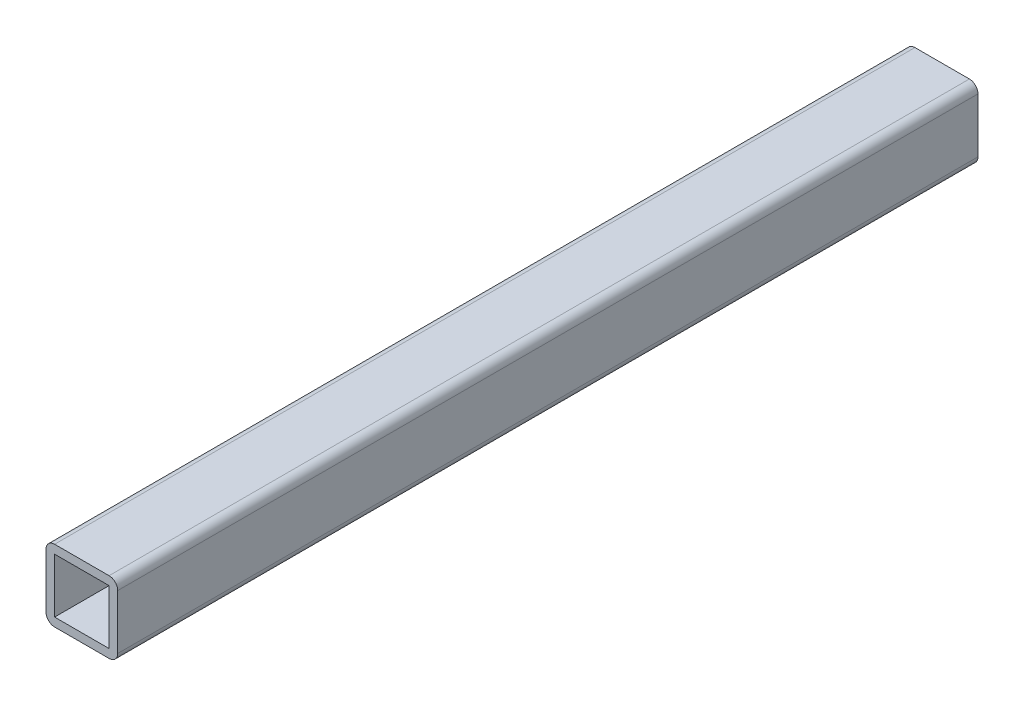
ISO-10303-21;
HEADER;
FILE_DESCRIPTION(('STEP AP214'),'2;1');
FILE_NAME('part.step','',(''),(''),'','','');
FILE_SCHEMA(('AUTOMOTIVE_DESIGN { 1 0 10303 214 1 1 1 1 }'));
ENDSEC;
DATA;
#1=APPLICATION_CONTEXT('core data for automotive mechanical design processes');
#2=APPLICATION_PROTOCOL_DEFINITION('international standard','automotive_design',2000,#1);
#3=PRODUCT_CONTEXT('',#1,'mechanical');
#4=PRODUCT('Part','Part','',(#3));
#5=PRODUCT_RELATED_PRODUCT_CATEGORY('part','',(#4));
#6=PRODUCT_DEFINITION_FORMATION('','',#4);
#7=PRODUCT_DEFINITION_CONTEXT('part definition',#1,'design');
#8=PRODUCT_DEFINITION('design','',#6,#7);
#9=PRODUCT_DEFINITION_SHAPE('','',#8);
#10=(LENGTH_UNIT() NAMED_UNIT(*) SI_UNIT(.MILLI.,.METRE.));
#11=(NAMED_UNIT(*) PLANE_ANGLE_UNIT() SI_UNIT($,.RADIAN.));
#12=(NAMED_UNIT(*) SI_UNIT($,.STERADIAN.) SOLID_ANGLE_UNIT());
#13=UNCERTAINTY_MEASURE_WITH_UNIT(LENGTH_MEASURE(1.E-05),#10,'distance_accuracy_value','');
#14=(GEOMETRIC_REPRESENTATION_CONTEXT(3) GLOBAL_UNCERTAINTY_ASSIGNED_CONTEXT((#13)) GLOBAL_UNIT_ASSIGNED_CONTEXT((#10,
#11,#12)) REPRESENTATION_CONTEXT('',''));
#15=CARTESIAN_POINT('',(0.,0.,0.));
#16=DIRECTION('',(0.,0.,1.));
#17=DIRECTION('',(1.,0.,0.));
#18=AXIS2_PLACEMENT_3D('',#15,#16,#17);
#19=CARTESIAN_POINT('',(-9.5,-9.5,300.));
#20=DIRECTION('',(0.,0.,1.));
#21=DIRECTION('',(1.,0.,0.));
#22=AXIS2_PLACEMENT_3D('',#19,#20,#21);
#23=PLANE('',#22);
#24=CARTESIAN_POINT('',(-9.5,-9.5,300.));
#25=DIRECTION('',(0.,0.,1.));
#26=DIRECTION('',(1.,0.,0.));
#27=AXIS2_PLACEMENT_3D('',#24,#25,#26);
#28=CIRCLE('',#27,3.);
#29=CARTESIAN_POINT('',(-12.5,-9.5,300.));
#30=VERTEX_POINT('',#29);
#31=CARTESIAN_POINT('',(-9.5,-12.5,300.));
#32=VERTEX_POINT('',#31);
#33=EDGE_CURVE('E157',#30,#32,#28,.T.);
#34=ORIENTED_EDGE('',*,*,#33,.T.);
#35=DIRECTION('',(1.,0.,0.));
#36=VECTOR('',#35,1.);
#37=CARTESIAN_POINT('',(-9.5,-12.5,300.));
#38=LINE('',#37,#36);
#39=CARTESIAN_POINT('',(9.5,-12.5,300.));
#40=VERTEX_POINT('',#39);
#41=EDGE_CURVE('E160',#32,#40,#38,.T.);
#42=ORIENTED_EDGE('',*,*,#41,.T.);
#43=CARTESIAN_POINT('',(9.5,-9.5,300.));
#44=DIRECTION('',(0.,0.,1.));
#45=DIRECTION('',(1.,0.,0.));
#46=AXIS2_PLACEMENT_3D('',#43,#44,#45);
#47=CIRCLE('',#46,3.);
#48=CARTESIAN_POINT('',(12.5,-9.5,300.));
#49=VERTEX_POINT('',#48);
#50=EDGE_CURVE('E163',#40,#49,#47,.T.);
#51=ORIENTED_EDGE('',*,*,#50,.T.);
#52=DIRECTION('',(0.,1.,0.));
#53=VECTOR('',#52,1.);
#54=CARTESIAN_POINT('',(12.5,-9.5,300.));
#55=LINE('',#54,#53);
#56=CARTESIAN_POINT('',(12.5,9.5,300.));
#57=VERTEX_POINT('',#56);
#58=EDGE_CURVE('E165',#49,#57,#55,.T.);
#59=ORIENTED_EDGE('',*,*,#58,.T.);
#60=CARTESIAN_POINT('',(9.5,9.5,300.));
#61=DIRECTION('',(0.,0.,1.));
#62=DIRECTION('',(1.,0.,0.));
#63=AXIS2_PLACEMENT_3D('',#60,#61,#62);
#64=CIRCLE('',#63,3.);
#65=CARTESIAN_POINT('',(9.5,12.5,300.));
#66=VERTEX_POINT('',#65);
#67=EDGE_CURVE('E167',#57,#66,#64,.T.);
#68=ORIENTED_EDGE('',*,*,#67,.T.);
#69=DIRECTION('',(-1.,0.,0.));
#70=VECTOR('',#69,1.);
#71=CARTESIAN_POINT('',(-9.5,12.5,300.));
#72=LINE('',#71,#70);
#73=CARTESIAN_POINT('',(-9.5,12.5,300.));
#74=VERTEX_POINT('',#73);
#75=EDGE_CURVE('E169',#66,#74,#72,.T.);
#76=ORIENTED_EDGE('',*,*,#75,.T.);
#77=CARTESIAN_POINT('',(-9.5,9.5,300.));
#78=DIRECTION('',(0.,0.,1.));
#79=DIRECTION('',(-1.,0.,0.));
#80=AXIS2_PLACEMENT_3D('',#77,#78,#79);
#81=CIRCLE('',#80,3.);
#82=CARTESIAN_POINT('',(-12.5,9.5,300.));
#83=VERTEX_POINT('',#82);
#84=EDGE_CURVE('E171',#74,#83,#81,.T.);
#85=ORIENTED_EDGE('',*,*,#84,.T.);
#86=DIRECTION('',(0.,-1.,0.));
#87=VECTOR('',#86,1.);
#88=CARTESIAN_POINT('',(-12.5,-9.5,300.));
#89=LINE('',#88,#87);
#90=EDGE_CURVE('E173',#83,#30,#89,.T.);
#91=ORIENTED_EDGE('',*,*,#90,.T.);
#92=EDGE_LOOP('',(#34,#42,#51,#59,#68,#76,#85,#91));
#93=FACE_BOUND('',#92,.T.);
#94=DIRECTION('',(1.,0.,0.));
#95=VECTOR('',#94,1.);
#96=CARTESIAN_POINT('',(-9.5,-9.5,300.));
#97=LINE('',#96,#95);
#98=CARTESIAN_POINT('',(-9.5,-9.5,300.));
#99=VERTEX_POINT('',#98);
#100=CARTESIAN_POINT('',(9.5,-9.5,300.));
#101=VERTEX_POINT('',#100);
#102=EDGE_CURVE('E129',#99,#101,#97,.T.);
#103=ORIENTED_EDGE('',*,*,#102,.F.);
#104=DIRECTION('',(0.,-1.,0.));
#105=VECTOR('',#104,1.);
#106=CARTESIAN_POINT('',(-9.5,-9.5,300.));
#107=LINE('',#106,#105);
#108=CARTESIAN_POINT('',(-9.5,9.5,300.));
#109=VERTEX_POINT('',#108);
#110=EDGE_CURVE('E121',#109,#99,#107,.T.);
#111=ORIENTED_EDGE('',*,*,#110,.F.);
#112=DIRECTION('',(-1.,0.,0.));
#113=VECTOR('',#112,1.);
#114=CARTESIAN_POINT('',(-9.5,9.5,300.));
#115=LINE('',#114,#113);
#116=CARTESIAN_POINT('',(9.49999999999999,9.5,300.));
#117=VERTEX_POINT('',#116);
#118=EDGE_CURVE('E143',#117,#109,#115,.T.);
#119=ORIENTED_EDGE('',*,*,#118,.F.);
#120=DIRECTION('',(0.,1.,0.));
#121=VECTOR('',#120,1.);
#122=CARTESIAN_POINT('',(9.5,-9.5,300.));
#123=LINE('',#122,#121);
#124=EDGE_CURVE('E141',#101,#117,#123,.T.);
#125=ORIENTED_EDGE('',*,*,#124,.F.);
#126=EDGE_LOOP('',(#103,#111,#119,#125));
#127=FACE_BOUND('',#126,.T.);
#128=ADVANCED_FACE('F32',(#93,#127),#23,.T.);
#129=CARTESIAN_POINT('',(-9.5,-9.5,0.));
#130=DIRECTION('',(0.,0.,1.));
#131=DIRECTION('',(1.,0.,0.));
#132=AXIS2_PLACEMENT_3D('',#129,#130,#131);
#133=PLANE('',#132);
#134=CARTESIAN_POINT('',(-9.5,-9.5,0.));
#135=DIRECTION('',(0.,0.,1.));
#136=DIRECTION('',(1.,0.,0.));
#137=AXIS2_PLACEMENT_3D('',#134,#135,#136);
#138=CIRCLE('',#137,3.);
#139=CARTESIAN_POINT('',(-12.5,-9.5,0.));
#140=VERTEX_POINT('',#139);
#141=CARTESIAN_POINT('',(-9.5,-12.5,0.));
#142=VERTEX_POINT('',#141);
#143=EDGE_CURVE('E137',#140,#142,#138,.T.);
#144=ORIENTED_EDGE('',*,*,#143,.F.);
#145=DIRECTION('',(0.,-1.,0.));
#146=VECTOR('',#145,1.);
#147=CARTESIAN_POINT('',(-12.5,-9.5,0.));
#148=LINE('',#147,#146);
#149=CARTESIAN_POINT('',(-12.5,9.5,0.));
#150=VERTEX_POINT('',#149);
#151=EDGE_CURVE('E161',#150,#140,#148,.T.);
#152=ORIENTED_EDGE('',*,*,#151,.F.);
#153=CARTESIAN_POINT('',(-9.5,9.5,0.));
#154=DIRECTION('',(0.,0.,1.));
#155=DIRECTION('',(-1.,0.,0.));
#156=AXIS2_PLACEMENT_3D('',#153,#154,#155);
#157=CIRCLE('',#156,3.);
#158=CARTESIAN_POINT('',(-9.5,12.5,0.));
#159=VERTEX_POINT('',#158);
#160=EDGE_CURVE('E188',#159,#150,#157,.T.);
#161=ORIENTED_EDGE('',*,*,#160,.F.);
#162=DIRECTION('',(-1.,0.,0.));
#163=VECTOR('',#162,1.);
#164=CARTESIAN_POINT('',(-9.5,12.5,0.));
#165=LINE('',#164,#163);
#166=CARTESIAN_POINT('',(9.5,12.5,0.));
#167=VERTEX_POINT('',#166);
#168=EDGE_CURVE('E186',#167,#159,#165,.T.);
#169=ORIENTED_EDGE('',*,*,#168,.F.);
#170=CARTESIAN_POINT('',(9.5,9.5,0.));
#171=DIRECTION('',(0.,0.,1.));
#172=DIRECTION('',(1.,0.,0.));
#173=AXIS2_PLACEMENT_3D('',#170,#171,#172);
#174=CIRCLE('',#173,3.);
#175=CARTESIAN_POINT('',(12.5,9.5,0.));
#176=VERTEX_POINT('',#175);
#177=EDGE_CURVE('E184',#176,#167,#174,.T.);
#178=ORIENTED_EDGE('',*,*,#177,.F.);
#179=DIRECTION('',(0.,1.,0.));
#180=VECTOR('',#179,1.);
#181=CARTESIAN_POINT('',(12.5,-9.5,0.));
#182=LINE('',#181,#180);
#183=CARTESIAN_POINT('',(12.5,-9.5,0.));
#184=VERTEX_POINT('',#183);
#185=EDGE_CURVE('E182',#184,#176,#182,.T.);
#186=ORIENTED_EDGE('',*,*,#185,.F.);
#187=CARTESIAN_POINT('',(9.5,-9.5,0.));
#188=DIRECTION('',(0.,0.,1.));
#189=DIRECTION('',(1.,0.,0.));
#190=AXIS2_PLACEMENT_3D('',#187,#188,#189);
#191=CIRCLE('',#190,3.);
#192=CARTESIAN_POINT('',(9.5,-12.5,0.));
#193=VERTEX_POINT('',#192);
#194=EDGE_CURVE('E180',#193,#184,#191,.T.);
#195=ORIENTED_EDGE('',*,*,#194,.F.);
#196=DIRECTION('',(1.,0.,0.));
#197=VECTOR('',#196,1.);
#198=CARTESIAN_POINT('',(-9.5,-12.5,0.));
#199=LINE('',#198,#197);
#200=EDGE_CURVE('E178',#142,#193,#199,.T.);
#201=ORIENTED_EDGE('',*,*,#200,.F.);
#202=EDGE_LOOP('',(#144,#152,#161,#169,#178,#186,#195,#201));
#203=FACE_BOUND('',#202,.T.);
#204=DIRECTION('',(0.,-1.,0.));
#205=VECTOR('',#204,1.);
#206=CARTESIAN_POINT('',(-9.5,-9.5,0.));
#207=LINE('',#206,#205);
#208=CARTESIAN_POINT('',(-9.5,9.5,0.));
#209=VERTEX_POINT('',#208);
#210=CARTESIAN_POINT('',(-9.5,-9.5,0.));
#211=VERTEX_POINT('',#210);
#212=EDGE_CURVE('E55',#209,#211,#207,.T.);
#213=ORIENTED_EDGE('',*,*,#212,.T.);
#214=DIRECTION('',(1.,0.,0.));
#215=VECTOR('',#214,1.);
#216=CARTESIAN_POINT('',(-9.5,-9.5,0.));
#217=LINE('',#216,#215);
#218=CARTESIAN_POINT('',(9.5,-9.5,0.));
#219=VERTEX_POINT('',#218);
#220=EDGE_CURVE('E136',#211,#219,#217,.T.);
#221=ORIENTED_EDGE('',*,*,#220,.T.);
#222=DIRECTION('',(0.,1.,0.));
#223=VECTOR('',#222,1.);
#224=CARTESIAN_POINT('',(9.5,-9.5,0.));
#225=LINE('',#224,#223);
#226=CARTESIAN_POINT('',(9.5,9.5,0.));
#227=VERTEX_POINT('',#226);
#228=EDGE_CURVE('E149',#219,#227,#225,.T.);
#229=ORIENTED_EDGE('',*,*,#228,.T.);
#230=DIRECTION('',(-1.,0.,0.));
#231=VECTOR('',#230,1.);
#232=CARTESIAN_POINT('',(-9.5,9.5,0.));
#233=LINE('',#232,#231);
#234=EDGE_CURVE('E130',#227,#209,#233,.T.);
#235=ORIENTED_EDGE('',*,*,#234,.T.);
#236=EDGE_LOOP('',(#213,#221,#229,#235));
#237=FACE_BOUND('',#236,.T.);
#238=ADVANCED_FACE('F218',(#203,#237),#133,.F.);
#239=CARTESIAN_POINT('',(-9.5,-9.5,300.));
#240=DIRECTION('',(0.,0.,-1.));
#241=DIRECTION('',(-1.,0.,0.));
#242=AXIS2_PLACEMENT_3D('',#239,#240,#241);
#243=CYLINDRICAL_SURFACE('',#242,3.);
#244=ORIENTED_EDGE('',*,*,#143,.T.);
#245=DIRECTION('',(0.,0.,-1.));
#246=VECTOR('',#245,1.);
#247=CARTESIAN_POINT('',(-9.5,-12.5,300.));
#248=LINE('',#247,#246);
#249=EDGE_CURVE('E11',#32,#142,#248,.T.);
#250=ORIENTED_EDGE('',*,*,#249,.F.);
#251=ORIENTED_EDGE('',*,*,#33,.F.);
#252=DIRECTION('',(0.,0.,-1.));
#253=VECTOR('',#252,1.);
#254=CARTESIAN_POINT('',(-12.5,-9.5,300.));
#255=LINE('',#254,#253);
#256=EDGE_CURVE('E175',#30,#140,#255,.T.);
#257=ORIENTED_EDGE('',*,*,#256,.T.);
#258=EDGE_LOOP('',(#244,#250,#251,#257));
#259=FACE_BOUND('',#258,.T.);
#260=ADVANCED_FACE('F34',(#259),#243,.T.);
#261=CARTESIAN_POINT('',(-9.5,-12.5,300.));
#262=DIRECTION('',(0.,1.,0.));
#263=DIRECTION('',(-1.,0.,0.));
#264=AXIS2_PLACEMENT_3D('',#261,#262,#263);
#265=PLANE('',#264);
#266=ORIENTED_EDGE('',*,*,#200,.T.);
#267=DIRECTION('',(0.,0.,-1.));
#268=VECTOR('',#267,1.);
#269=CARTESIAN_POINT('',(9.5,-12.5,300.));
#270=LINE('',#269,#268);
#271=EDGE_CURVE('E40',#40,#193,#270,.T.);
#272=ORIENTED_EDGE('',*,*,#271,.F.);
#273=ORIENTED_EDGE('',*,*,#41,.F.);
#274=ORIENTED_EDGE('',*,*,#249,.T.);
#275=EDGE_LOOP('',(#266,#272,#273,#274));
#276=FACE_BOUND('',#275,.T.);
#277=ADVANCED_FACE('F235',(#276),#265,.F.);
#278=CARTESIAN_POINT('',(9.5,-9.5,300.));
#279=DIRECTION('',(0.,0.,-1.));
#280=DIRECTION('',(-1.,0.,0.));
#281=AXIS2_PLACEMENT_3D('',#278,#279,#280);
#282=CYLINDRICAL_SURFACE('',#281,3.);
#283=ORIENTED_EDGE('',*,*,#194,.T.);
#284=DIRECTION('',(0.,0.,-1.));
#285=VECTOR('',#284,1.);
#286=CARTESIAN_POINT('',(12.5,-9.5,300.));
#287=LINE('',#286,#285);
#288=EDGE_CURVE('E205',#49,#184,#287,.T.);
#289=ORIENTED_EDGE('',*,*,#288,.F.);
#290=ORIENTED_EDGE('',*,*,#50,.F.);
#291=ORIENTED_EDGE('',*,*,#271,.T.);
#292=EDGE_LOOP('',(#283,#289,#290,#291));
#293=FACE_BOUND('',#292,.T.);
#294=ADVANCED_FACE('F212',(#293),#282,.T.);
#295=CARTESIAN_POINT('',(12.5,-9.5,300.));
#296=DIRECTION('',(-1.,0.,0.));
#297=DIRECTION('',(0.,-1.,0.));
#298=AXIS2_PLACEMENT_3D('',#295,#296,#297);
#299=PLANE('',#298);
#300=ORIENTED_EDGE('',*,*,#185,.T.);
#301=DIRECTION('',(0.,0.,-1.));
#302=VECTOR('',#301,1.);
#303=CARTESIAN_POINT('',(12.5,9.5,300.));
#304=LINE('',#303,#302);
#305=EDGE_CURVE('E202',#57,#176,#304,.T.);
#306=ORIENTED_EDGE('',*,*,#305,.F.);
#307=ORIENTED_EDGE('',*,*,#58,.F.);
#308=ORIENTED_EDGE('',*,*,#288,.T.);
#309=EDGE_LOOP('',(#300,#306,#307,#308));
#310=FACE_BOUND('',#309,.T.);
#311=ADVANCED_FACE('F224',(#310),#299,.F.);
#312=CARTESIAN_POINT('',(9.5,9.5,300.));
#313=DIRECTION('',(0.,0.,-1.));
#314=DIRECTION('',(-1.,0.,0.));
#315=AXIS2_PLACEMENT_3D('',#312,#313,#314);
#316=CYLINDRICAL_SURFACE('',#315,3.);
#317=ORIENTED_EDGE('',*,*,#177,.T.);
#318=DIRECTION('',(0.,0.,-1.));
#319=VECTOR('',#318,1.);
#320=CARTESIAN_POINT('',(9.5,12.5,300.));
#321=LINE('',#320,#319);
#322=EDGE_CURVE('E199',#66,#167,#321,.T.);
#323=ORIENTED_EDGE('',*,*,#322,.F.);
#324=ORIENTED_EDGE('',*,*,#67,.F.);
#325=ORIENTED_EDGE('',*,*,#305,.T.);
#326=EDGE_LOOP('',(#317,#323,#324,#325));
#327=FACE_BOUND('',#326,.T.);
#328=ADVANCED_FACE('F228',(#327),#316,.T.);
#329=CARTESIAN_POINT('',(-9.5,12.5,300.));
#330=DIRECTION('',(0.,-1.,0.));
#331=DIRECTION('',(0.,0.,-1.));
#332=AXIS2_PLACEMENT_3D('',#329,#330,#331);
#333=PLANE('',#332);
#334=ORIENTED_EDGE('',*,*,#168,.T.);
#335=DIRECTION('',(0.,0.,-1.));
#336=VECTOR('',#335,1.);
#337=CARTESIAN_POINT('',(-9.5,12.5,300.));
#338=LINE('',#337,#336);
#339=EDGE_CURVE('E196',#74,#159,#338,.T.);
#340=ORIENTED_EDGE('',*,*,#339,.F.);
#341=ORIENTED_EDGE('',*,*,#75,.F.);
#342=ORIENTED_EDGE('',*,*,#322,.T.);
#343=EDGE_LOOP('',(#334,#340,#341,#342));
#344=FACE_BOUND('',#343,.T.);
#345=ADVANCED_FACE('F248',(#344),#333,.F.);
#346=CARTESIAN_POINT('',(-9.5,9.5,300.));
#347=DIRECTION('',(0.,0.,-1.));
#348=DIRECTION('',(-1.,0.,0.));
#349=AXIS2_PLACEMENT_3D('',#346,#347,#348);
#350=CYLINDRICAL_SURFACE('',#349,3.);
#351=ORIENTED_EDGE('',*,*,#160,.T.);
#352=DIRECTION('',(0.,0.,-1.));
#353=VECTOR('',#352,1.);
#354=CARTESIAN_POINT('',(-12.5,9.5,300.));
#355=LINE('',#354,#353);
#356=EDGE_CURVE('E193',#83,#150,#355,.T.);
#357=ORIENTED_EDGE('',*,*,#356,.F.);
#358=ORIENTED_EDGE('',*,*,#84,.F.);
#359=ORIENTED_EDGE('',*,*,#339,.T.);
#360=EDGE_LOOP('',(#351,#357,#358,#359));
#361=FACE_BOUND('',#360,.T.);
#362=ADVANCED_FACE('F246',(#361),#350,.T.);
#363=CARTESIAN_POINT('',(-12.5,-9.5,300.));
#364=DIRECTION('',(1.,0.,0.));
#365=DIRECTION('',(0.,0.,-1.));
#366=AXIS2_PLACEMENT_3D('',#363,#364,#365);
#367=PLANE('',#366);
#368=ORIENTED_EDGE('',*,*,#151,.T.);
#369=ORIENTED_EDGE('',*,*,#256,.F.);
#370=ORIENTED_EDGE('',*,*,#90,.F.);
#371=ORIENTED_EDGE('',*,*,#356,.T.);
#372=EDGE_LOOP('',(#368,#369,#370,#371));
#373=FACE_BOUND('',#372,.T.);
#374=ADVANCED_FACE('F241',(#373),#367,.F.);
#375=CARTESIAN_POINT('',(-9.5,-9.5,300.));
#376=DIRECTION('',(1.,0.,0.));
#377=DIRECTION('',(0.,0.,-1.));
#378=AXIS2_PLACEMENT_3D('',#375,#376,#377);
#379=PLANE('',#378);
#380=ORIENTED_EDGE('',*,*,#212,.F.);
#381=DIRECTION('',(0.,0.,-1.));
#382=VECTOR('',#381,1.);
#383=CARTESIAN_POINT('',(-9.5,9.5,300.));
#384=LINE('',#383,#382);
#385=EDGE_CURVE('E125',#109,#209,#384,.T.);
#386=ORIENTED_EDGE('',*,*,#385,.F.);
#387=ORIENTED_EDGE('',*,*,#110,.T.);
#388=DIRECTION('',(0.,0.,-1.));
#389=VECTOR('',#388,1.);
#390=CARTESIAN_POINT('',(-9.5,-9.5,300.));
#391=LINE('',#390,#389);
#392=EDGE_CURVE('E124',#99,#211,#391,.T.);
#393=ORIENTED_EDGE('',*,*,#392,.T.);
#394=EDGE_LOOP('',(#380,#386,#387,#393));
#395=FACE_BOUND('',#394,.T.);
#396=ADVANCED_FACE('F123',(#395),#379,.T.);
#397=CARTESIAN_POINT('',(-9.5,-9.5,300.));
#398=DIRECTION('',(0.,1.,0.));
#399=DIRECTION('',(0.,0.,1.));
#400=AXIS2_PLACEMENT_3D('',#397,#398,#399);
#401=PLANE('',#400);
#402=ORIENTED_EDGE('',*,*,#220,.F.);
#403=ORIENTED_EDGE('',*,*,#392,.F.);
#404=ORIENTED_EDGE('',*,*,#102,.T.);
#405=DIRECTION('',(0.,0.,-1.));
#406=VECTOR('',#405,1.);
#407=CARTESIAN_POINT('',(9.5,-9.5,300.));
#408=LINE('',#407,#406);
#409=EDGE_CURVE('E138',#101,#219,#408,.T.);
#410=ORIENTED_EDGE('',*,*,#409,.T.);
#411=EDGE_LOOP('',(#402,#403,#404,#410));
#412=FACE_BOUND('',#411,.T.);
#413=ADVANCED_FACE('F133',(#412),#401,.T.);
#414=CARTESIAN_POINT('',(9.5,-9.5,300.));
#415=DIRECTION('',(-1.,0.,0.));
#416=DIRECTION('',(0.,-1.,0.));
#417=AXIS2_PLACEMENT_3D('',#414,#415,#416);
#418=PLANE('',#417);
#419=ORIENTED_EDGE('',*,*,#228,.F.);
#420=ORIENTED_EDGE('',*,*,#409,.F.);
#421=ORIENTED_EDGE('',*,*,#124,.T.);
#422=DIRECTION('',(0.,0.,-1.));
#423=VECTOR('',#422,1.);
#424=CARTESIAN_POINT('',(9.5,9.5,300.));
#425=LINE('',#424,#423);
#426=EDGE_CURVE('E47',#117,#227,#425,.T.);
#427=ORIENTED_EDGE('',*,*,#426,.T.);
#428=EDGE_LOOP('',(#419,#420,#421,#427));
#429=FACE_BOUND('',#428,.T.);
#430=ADVANCED_FACE('F273',(#429),#418,.T.);
#431=CARTESIAN_POINT('',(-9.5,9.5,300.));
#432=DIRECTION('',(0.,-1.,0.));
#433=DIRECTION('',(0.,0.,-1.));
#434=AXIS2_PLACEMENT_3D('',#431,#432,#433);
#435=PLANE('',#434);
#436=ORIENTED_EDGE('',*,*,#234,.F.);
#437=ORIENTED_EDGE('',*,*,#426,.F.);
#438=ORIENTED_EDGE('',*,*,#118,.T.);
#439=ORIENTED_EDGE('',*,*,#385,.T.);
#440=EDGE_LOOP('',(#436,#437,#438,#439));
#441=FACE_BOUND('',#440,.T.);
#442=ADVANCED_FACE('F277',(#441),#435,.T.);
#443=CLOSED_SHELL('',(#128,#238,#260,#277,#294,#311,#328,#345,#362,#374,#396,#413,#430,#442));
#444=MANIFOLD_SOLID_BREP('B2',#443);
#445=ADVANCED_BREP_SHAPE_REPRESENTATION('',(#18,#444),#14);
#446=SHAPE_DEFINITION_REPRESENTATION(#9,#445);
ENDSEC;
END-ISO-10303-21;
